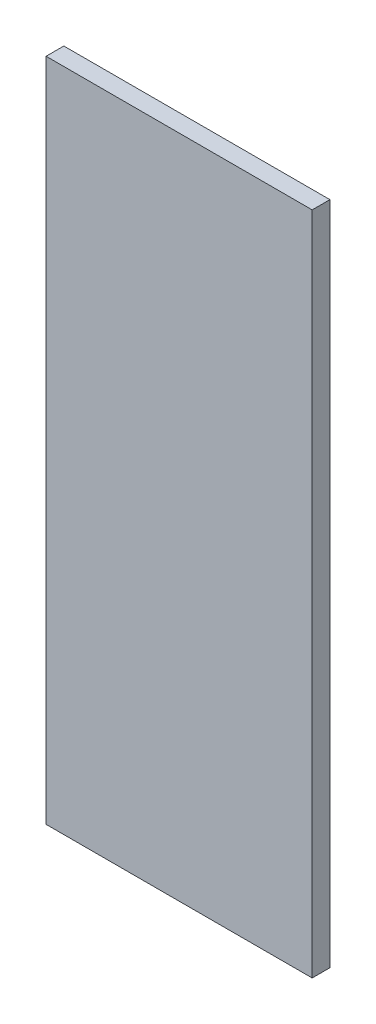
ISO-10303-21;
HEADER;
FILE_DESCRIPTION(('STEP AP214'),'2;1');
FILE_NAME('part.step','',(''),(''),'','','');
FILE_SCHEMA(('AUTOMOTIVE_DESIGN { 1 0 10303 214 1 1 1 1 }'));
ENDSEC;
DATA;
#1=APPLICATION_CONTEXT('core data for automotive mechanical design processes');
#2=APPLICATION_PROTOCOL_DEFINITION('international standard','automotive_design',2000,#1);
#3=PRODUCT_CONTEXT('',#1,'mechanical');
#4=PRODUCT('Part','Part','',(#3));
#5=PRODUCT_RELATED_PRODUCT_CATEGORY('part','',(#4));
#6=PRODUCT_DEFINITION_FORMATION('','',#4);
#7=PRODUCT_DEFINITION_CONTEXT('part definition',#1,'design');
#8=PRODUCT_DEFINITION('design','',#6,#7);
#9=PRODUCT_DEFINITION_SHAPE('','',#8);
#10=(LENGTH_UNIT() NAMED_UNIT(*) SI_UNIT(.MILLI.,.METRE.));
#11=(NAMED_UNIT(*) PLANE_ANGLE_UNIT() SI_UNIT($,.RADIAN.));
#12=(NAMED_UNIT(*) SI_UNIT($,.STERADIAN.) SOLID_ANGLE_UNIT());
#13=UNCERTAINTY_MEASURE_WITH_UNIT(LENGTH_MEASURE(1.E-05),#10,'distance_accuracy_value','');
#14=(GEOMETRIC_REPRESENTATION_CONTEXT(3) GLOBAL_UNCERTAINTY_ASSIGNED_CONTEXT((#13)) GLOBAL_UNIT_ASSIGNED_CONTEXT((#10,
#11,#12)) REPRESENTATION_CONTEXT('',''));
#15=CARTESIAN_POINT('',(0.,0.,0.));
#16=DIRECTION('',(0.,0.,1.));
#17=DIRECTION('',(1.,0.,0.));
#18=AXIS2_PLACEMENT_3D('',#15,#16,#17);
#19=CARTESIAN_POINT('',(152.4,381.,0.));
#20=DIRECTION('',(0.,0.,-1.));
#21=DIRECTION('',(-1.,0.,0.));
#22=AXIS2_PLACEMENT_3D('',#19,#20,#21);
#23=PLANE('',#22);
#24=DIRECTION('',(1.,0.,0.));
#25=VECTOR('',#24,1.);
#26=CARTESIAN_POINT('',(152.4,0.,0.));
#27=LINE('',#26,#25);
#28=CARTESIAN_POINT('',(0.,0.,0.));
#29=VERTEX_POINT('',#28);
#30=CARTESIAN_POINT('',(152.4,0.,0.));
#31=VERTEX_POINT('',#30);
#32=EDGE_CURVE('E113',#29,#31,#27,.T.);
#33=ORIENTED_EDGE('',*,*,#32,.T.);
#34=DIRECTION('',(0.,-1.,0.));
#35=VECTOR('',#34,1.);
#36=CARTESIAN_POINT('',(152.4,381.,0.));
#37=LINE('',#36,#35);
#38=CARTESIAN_POINT('',(152.4,381.,0.));
#39=VERTEX_POINT('',#38);
#40=EDGE_CURVE('E11',#39,#31,#37,.T.);
#41=ORIENTED_EDGE('',*,*,#40,.F.);
#42=DIRECTION('',(1.,0.,0.));
#43=VECTOR('',#42,1.);
#44=CARTESIAN_POINT('',(152.4,381.,0.));
#45=LINE('',#44,#43);
#46=CARTESIAN_POINT('',(0.,381.,0.));
#47=VERTEX_POINT('',#46);
#48=EDGE_CURVE('E97',#47,#39,#45,.T.);
#49=ORIENTED_EDGE('',*,*,#48,.F.);
#50=DIRECTION('',(0.,-1.,0.));
#51=VECTOR('',#50,1.);
#52=CARTESIAN_POINT('',(0.,381.,0.));
#53=LINE('',#52,#51);
#54=EDGE_CURVE('E109',#47,#29,#53,.T.);
#55=ORIENTED_EDGE('',*,*,#54,.T.);
#56=EDGE_LOOP('',(#33,#41,#49,#55));
#57=FACE_BOUND('',#56,.T.);
#58=ADVANCED_FACE('F45',(#57),#23,.F.);
#59=CARTESIAN_POINT('',(152.4,381.,-10.16));
#60=DIRECTION('',(-1.,0.,0.));
#61=DIRECTION('',(0.,0.,1.));
#62=AXIS2_PLACEMENT_3D('',#59,#60,#61);
#63=PLANE('',#62);
#64=DIRECTION('',(0.,0.,-1.));
#65=VECTOR('',#64,1.);
#66=CARTESIAN_POINT('',(152.4,0.,-10.16));
#67=LINE('',#66,#65);
#68=CARTESIAN_POINT('',(152.4,0.,-10.16));
#69=VERTEX_POINT('',#68);
#70=EDGE_CURVE('E102',#31,#69,#67,.T.);
#71=ORIENTED_EDGE('',*,*,#70,.T.);
#72=DIRECTION('',(0.,-1.,0.));
#73=VECTOR('',#72,1.);
#74=CARTESIAN_POINT('',(152.4,381.,-10.16));
#75=LINE('',#74,#73);
#76=CARTESIAN_POINT('',(152.4,381.,-10.16));
#77=VERTEX_POINT('',#76);
#78=EDGE_CURVE('E54',#77,#69,#75,.T.);
#79=ORIENTED_EDGE('',*,*,#78,.F.);
#80=DIRECTION('',(0.,0.,-1.));
#81=VECTOR('',#80,1.);
#82=CARTESIAN_POINT('',(152.4,381.,-10.16));
#83=LINE('',#82,#81);
#84=EDGE_CURVE('E92',#39,#77,#83,.T.);
#85=ORIENTED_EDGE('',*,*,#84,.F.);
#86=ORIENTED_EDGE('',*,*,#40,.T.);
#87=EDGE_LOOP('',(#71,#79,#85,#86));
#88=FACE_BOUND('',#87,.T.);
#89=ADVANCED_FACE('F101',(#88),#63,.F.);
#90=CARTESIAN_POINT('',(0.,381.,-10.16));
#91=DIRECTION('',(0.,0.,1.));
#92=DIRECTION('',(1.,0.,0.));
#93=AXIS2_PLACEMENT_3D('',#90,#91,#92);
#94=PLANE('',#93);
#95=DIRECTION('',(-1.,0.,0.));
#96=VECTOR('',#95,1.);
#97=CARTESIAN_POINT('',(0.,0.,-10.16));
#98=LINE('',#97,#96);
#99=CARTESIAN_POINT('',(0.,0.,-10.16));
#100=VERTEX_POINT('',#99);
#101=EDGE_CURVE('E79',#69,#100,#98,.T.);
#102=ORIENTED_EDGE('',*,*,#101,.T.);
#103=DIRECTION('',(0.,-1.,0.));
#104=VECTOR('',#103,1.);
#105=CARTESIAN_POINT('',(0.,381.,-10.16));
#106=LINE('',#105,#104);
#107=CARTESIAN_POINT('',(0.,381.,-10.16));
#108=VERTEX_POINT('',#107);
#109=EDGE_CURVE('E104',#108,#100,#106,.T.);
#110=ORIENTED_EDGE('',*,*,#109,.F.);
#111=DIRECTION('',(-1.,0.,0.));
#112=VECTOR('',#111,1.);
#113=CARTESIAN_POINT('',(0.,381.,-10.16));
#114=LINE('',#113,#112);
#115=EDGE_CURVE('E95',#77,#108,#114,.T.);
#116=ORIENTED_EDGE('',*,*,#115,.F.);
#117=ORIENTED_EDGE('',*,*,#78,.T.);
#118=EDGE_LOOP('',(#102,#110,#116,#117));
#119=FACE_BOUND('',#118,.T.);
#120=ADVANCED_FACE('F105',(#119),#94,.F.);
#121=CARTESIAN_POINT('',(0.,381.,0.));
#122=DIRECTION('',(1.,0.,0.));
#123=DIRECTION('',(0.,0.,-1.));
#124=AXIS2_PLACEMENT_3D('',#121,#122,#123);
#125=PLANE('',#124);
#126=DIRECTION('',(0.,0.,1.));
#127=VECTOR('',#126,1.);
#128=CARTESIAN_POINT('',(0.,0.,0.));
#129=LINE('',#128,#127);
#130=EDGE_CURVE('E85',#100,#29,#129,.T.);
#131=ORIENTED_EDGE('',*,*,#130,.T.);
#132=ORIENTED_EDGE('',*,*,#54,.F.);
#133=DIRECTION('',(0.,0.,1.));
#134=VECTOR('',#133,1.);
#135=CARTESIAN_POINT('',(0.,381.,0.));
#136=LINE('',#135,#134);
#137=EDGE_CURVE('E62',#108,#47,#136,.T.);
#138=ORIENTED_EDGE('',*,*,#137,.F.);
#139=ORIENTED_EDGE('',*,*,#109,.T.);
#140=EDGE_LOOP('',(#131,#132,#138,#139));
#141=FACE_BOUND('',#140,.T.);
#142=ADVANCED_FACE('F126',(#141),#125,.F.);
#143=CARTESIAN_POINT('',(0.,381.,0.));
#144=DIRECTION('',(0.,-1.,0.));
#145=DIRECTION('',(0.,0.,-1.));
#146=AXIS2_PLACEMENT_3D('',#143,#144,#145);
#147=PLANE('',#146);
#148=ORIENTED_EDGE('',*,*,#48,.T.);
#149=ORIENTED_EDGE('',*,*,#84,.T.);
#150=ORIENTED_EDGE('',*,*,#115,.T.);
#151=ORIENTED_EDGE('',*,*,#137,.T.);
#152=EDGE_LOOP('',(#148,#149,#150,#151));
#153=FACE_BOUND('',#152,.T.);
#154=ADVANCED_FACE('F93',(#153),#147,.F.);
#155=CARTESIAN_POINT('',(0.,0.,0.));
#156=DIRECTION('',(0.,-1.,0.));
#157=DIRECTION('',(0.,0.,-1.));
#158=AXIS2_PLACEMENT_3D('',#155,#156,#157);
#159=PLANE('',#158);
#160=ORIENTED_EDGE('',*,*,#32,.F.);
#161=ORIENTED_EDGE('',*,*,#130,.F.);
#162=ORIENTED_EDGE('',*,*,#101,.F.);
#163=ORIENTED_EDGE('',*,*,#70,.F.);
#164=EDGE_LOOP('',(#160,#161,#162,#163));
#165=FACE_BOUND('',#164,.T.);
#166=ADVANCED_FACE('F129',(#165),#159,.T.);
#167=CLOSED_SHELL('',(#58,#89,#120,#142,#154,#166));
#168=MANIFOLD_SOLID_BREP('B2',#167);
#169=ADVANCED_BREP_SHAPE_REPRESENTATION('',(#18,#168),#14);
#170=SHAPE_DEFINITION_REPRESENTATION(#9,#169);
ENDSEC;
END-ISO-10303-21;
